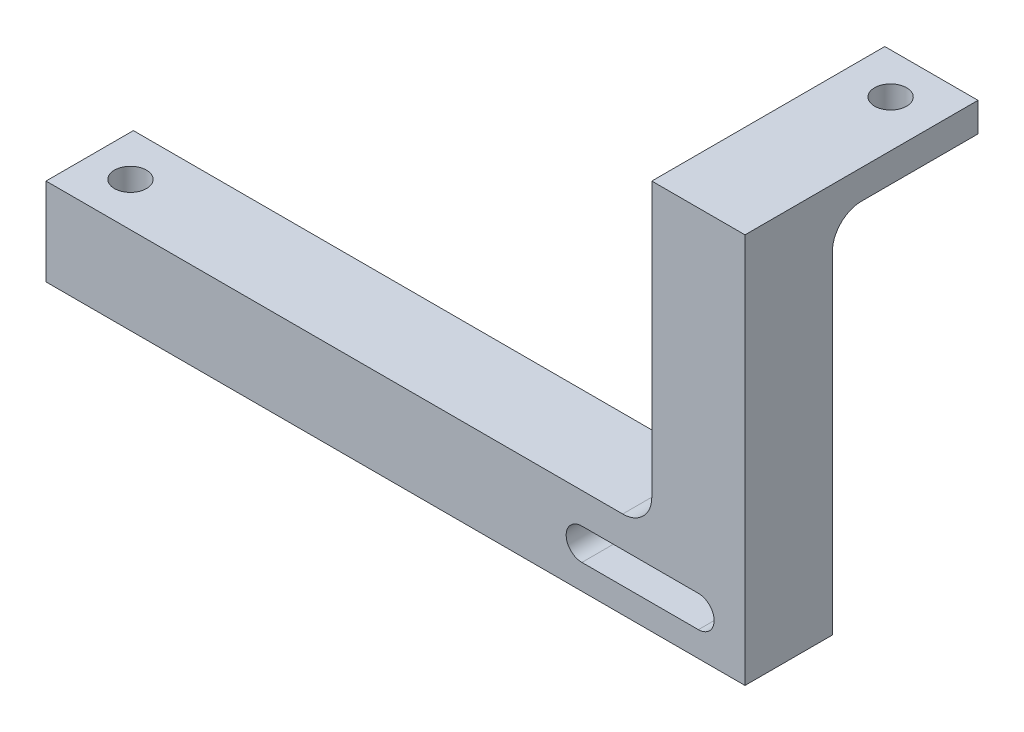
ISO-10303-21;
HEADER;
FILE_DESCRIPTION(('STEP AP214'),'2;1');
FILE_NAME('part.step','',(''),(''),'','','');
FILE_SCHEMA(('AUTOMOTIVE_DESIGN { 1 0 10303 214 1 1 1 1 }'));
ENDSEC;
DATA;
#1=APPLICATION_CONTEXT('core data for automotive mechanical design processes');
#2=APPLICATION_PROTOCOL_DEFINITION('international standard','automotive_design',2000,#1);
#3=PRODUCT_CONTEXT('',#1,'mechanical');
#4=PRODUCT('Part','Part','',(#3));
#5=PRODUCT_RELATED_PRODUCT_CATEGORY('part','',(#4));
#6=PRODUCT_DEFINITION_FORMATION('','',#4);
#7=PRODUCT_DEFINITION_CONTEXT('part definition',#1,'design');
#8=PRODUCT_DEFINITION('design','',#6,#7);
#9=PRODUCT_DEFINITION_SHAPE('','',#8);
#10=(LENGTH_UNIT() NAMED_UNIT(*) SI_UNIT(.MILLI.,.METRE.));
#11=(NAMED_UNIT(*) PLANE_ANGLE_UNIT() SI_UNIT($,.RADIAN.));
#12=(NAMED_UNIT(*) SI_UNIT($,.STERADIAN.) SOLID_ANGLE_UNIT());
#13=UNCERTAINTY_MEASURE_WITH_UNIT(LENGTH_MEASURE(1.E-05),#10,'distance_accuracy_value','');
#14=(GEOMETRIC_REPRESENTATION_CONTEXT(3) GLOBAL_UNCERTAINTY_ASSIGNED_CONTEXT((#13)) GLOBAL_UNIT_ASSIGNED_CONTEXT((#10,
#11,#12)) REPRESENTATION_CONTEXT('',''));
#15=CARTESIAN_POINT('',(0.,0.,0.));
#16=DIRECTION('',(0.,0.,1.));
#17=DIRECTION('',(1.,0.,0.));
#18=AXIS2_PLACEMENT_3D('',#15,#16,#17);
#19=CARTESIAN_POINT('',(0.,62.,15.));
#20=DIRECTION('',(-1.,0.,0.));
#21=DIRECTION('',(0.,-1.,0.));
#22=AXIS2_PLACEMENT_3D('',#19,#20,#21);
#23=PLANE('',#22);
#24=DIRECTION('',(0.,1.,0.));
#25=VECTOR('',#24,1.);
#26=CARTESIAN_POINT('',(0.,62.,0.));
#27=LINE('',#26,#25);
#28=CARTESIAN_POINT('',(0.,0.,0.));
#29=VERTEX_POINT('',#28);
#30=CARTESIAN_POINT('',(0.,57.,0.));
#31=VERTEX_POINT('',#30);
#32=EDGE_CURVE('E186',#29,#31,#27,.T.);
#33=ORIENTED_EDGE('',*,*,#32,.T.);
#34=CARTESIAN_POINT('',(0.,57.,-5.));
#35=DIRECTION('',(-1.,0.,0.));
#36=DIRECTION('',(0.,-1.,0.));
#37=AXIS2_PLACEMENT_3D('',#34,#35,#36);
#38=CIRCLE('',#37,5.);
#39=CARTESIAN_POINT('',(0.,62.,-5.));
#40=VERTEX_POINT('',#39);
#41=EDGE_CURVE('E242',#31,#40,#38,.T.);
#42=ORIENTED_EDGE('',*,*,#41,.T.);
#43=DIRECTION('',(0.,0.,1.));
#44=VECTOR('',#43,1.);
#45=CARTESIAN_POINT('',(0.,62.,-25.));
#46=LINE('',#45,#44);
#47=CARTESIAN_POINT('',(0.,62.,-25.));
#48=VERTEX_POINT('',#47);
#49=EDGE_CURVE('E190',#48,#40,#46,.T.);
#50=ORIENTED_EDGE('',*,*,#49,.F.);
#51=DIRECTION('',(0.,1.,0.));
#52=VECTOR('',#51,1.);
#53=CARTESIAN_POINT('',(0.,62.,-25.));
#54=LINE('',#53,#52);
#55=CARTESIAN_POINT('',(0.,67.,-25.));
#56=VERTEX_POINT('',#55);
#57=EDGE_CURVE('E174',#48,#56,#54,.T.);
#58=ORIENTED_EDGE('',*,*,#57,.T.);
#59=DIRECTION('',(0.,0.,1.));
#60=VECTOR('',#59,1.);
#61=CARTESIAN_POINT('',(0.,67.,-25.));
#62=LINE('',#61,#60);
#63=CARTESIAN_POINT('',(0.,67.,15.));
#64=VERTEX_POINT('',#63);
#65=EDGE_CURVE('E187',#56,#64,#62,.T.);
#66=ORIENTED_EDGE('',*,*,#65,.T.);
#67=DIRECTION('',(0.,1.,0.));
#68=VECTOR('',#67,1.);
#69=CARTESIAN_POINT('',(0.,62.,15.));
#70=LINE('',#69,#68);
#71=CARTESIAN_POINT('',(0.,0.,15.));
#72=VERTEX_POINT('',#71);
#73=EDGE_CURVE('E195',#72,#64,#70,.T.);
#74=ORIENTED_EDGE('',*,*,#73,.F.);
#75=DIRECTION('',(0.,0.,-1.));
#76=VECTOR('',#75,1.);
#77=CARTESIAN_POINT('',(0.,0.,15.));
#78=LINE('',#77,#76);
#79=EDGE_CURVE('E206',#72,#29,#78,.T.);
#80=ORIENTED_EDGE('',*,*,#79,.T.);
#81=EDGE_LOOP('',(#33,#42,#50,#58,#66,#74,#80));
#82=FACE_BOUND('',#81,.T.);
#83=ADVANCED_FACE('F33',(#82),#23,.F.);
#84=CARTESIAN_POINT('',(-16.,62.,15.));
#85=DIRECTION('',(1.,0.,0.));
#86=DIRECTION('',(0.,1.,0.));
#87=AXIS2_PLACEMENT_3D('',#84,#85,#86);
#88=PLANE('',#87);
#89=DIRECTION('',(0.,-1.,0.));
#90=VECTOR('',#89,1.);
#91=CARTESIAN_POINT('',(-16.,62.,0.));
#92=LINE('',#91,#90);
#93=CARTESIAN_POINT('',(-16.,57.,0.));
#94=VERTEX_POINT('',#93);
#95=CARTESIAN_POINT('',(-16.,20.,0.));
#96=VERTEX_POINT('',#95);
#97=EDGE_CURVE('E209',#94,#96,#92,.T.);
#98=ORIENTED_EDGE('',*,*,#97,.T.);
#99=DIRECTION('',(0.,0.,-1.));
#100=VECTOR('',#99,1.);
#101=CARTESIAN_POINT('',(-16.,20.,15.));
#102=LINE('',#101,#100);
#103=CARTESIAN_POINT('',(-16.,20.,15.));
#104=VERTEX_POINT('',#103);
#105=EDGE_CURVE('E48',#96,#104,#102,.F.);
#106=ORIENTED_EDGE('',*,*,#105,.T.);
#107=DIRECTION('',(0.,-1.,0.));
#108=VECTOR('',#107,1.);
#109=CARTESIAN_POINT('',(-16.,62.,15.));
#110=LINE('',#109,#108);
#111=CARTESIAN_POINT('',(-16.,67.,15.));
#112=VERTEX_POINT('',#111);
#113=EDGE_CURVE('E197',#112,#104,#110,.T.);
#114=ORIENTED_EDGE('',*,*,#113,.F.);
#115=DIRECTION('',(0.,0.,1.));
#116=VECTOR('',#115,1.);
#117=CARTESIAN_POINT('',(-16.,67.,-25.));
#118=LINE('',#117,#116);
#119=CARTESIAN_POINT('',(-16.,67.,-25.));
#120=VERTEX_POINT('',#119);
#121=EDGE_CURVE('E183',#120,#112,#118,.T.);
#122=ORIENTED_EDGE('',*,*,#121,.F.);
#123=DIRECTION('',(0.,-1.,0.));
#124=VECTOR('',#123,1.);
#125=CARTESIAN_POINT('',(-16.,62.,-25.));
#126=LINE('',#125,#124);
#127=CARTESIAN_POINT('',(-16.,62.,-25.));
#128=VERTEX_POINT('',#127);
#129=EDGE_CURVE('E168',#120,#128,#126,.T.);
#130=ORIENTED_EDGE('',*,*,#129,.T.);
#131=DIRECTION('',(0.,0.,1.));
#132=VECTOR('',#131,1.);
#133=CARTESIAN_POINT('',(-16.,62.,-25.));
#134=LINE('',#133,#132);
#135=CARTESIAN_POINT('',(-16.,62.,-5.));
#136=VERTEX_POINT('',#135);
#137=EDGE_CURVE('E180',#128,#136,#134,.T.);
#138=ORIENTED_EDGE('',*,*,#137,.T.);
#139=CARTESIAN_POINT('',(-16.,57.,-5.));
#140=DIRECTION('',(1.,0.,0.));
#141=DIRECTION('',(0.,1.,0.));
#142=AXIS2_PLACEMENT_3D('',#139,#140,#141);
#143=CIRCLE('',#142,5.);
#144=EDGE_CURVE('E240',#136,#94,#143,.T.);
#145=ORIENTED_EDGE('',*,*,#144,.T.);
#146=EDGE_LOOP('',(#98,#106,#114,#122,#130,#138,#145));
#147=FACE_BOUND('',#146,.T.);
#148=ADVANCED_FACE('F251',(#147),#88,.F.);
#149=CARTESIAN_POINT('',(-120.,15.,15.));
#150=DIRECTION('',(0.,-1.,0.));
#151=DIRECTION('',(0.,0.,-1.));
#152=AXIS2_PLACEMENT_3D('',#149,#150,#151);
#153=PLANE('',#152);
#154=CARTESIAN_POINT('',(-113.,15.,7.5));
#155=DIRECTION('',(0.,-1.,0.));
#156=DIRECTION('',(0.,0.,-1.));
#157=AXIS2_PLACEMENT_3D('',#154,#155,#156);
#158=CIRCLE('',#157,2.74999999999999);
#159=CARTESIAN_POINT('',(-113.,15.,4.75000000000001));
#160=VERTEX_POINT('',#159);
#161=EDGE_CURVE('E341',#160,#160,#158,.T.);
#162=ORIENTED_EDGE('',*,*,#161,.T.);
#163=EDGE_LOOP('',(#162));
#164=FACE_BOUND('',#163,.T.);
#165=DIRECTION('',(-1.,0.,0.));
#166=VECTOR('',#165,1.);
#167=CARTESIAN_POINT('',(-120.,15.,15.));
#168=LINE('',#167,#166);
#169=CARTESIAN_POINT('',(-21.,15.,15.));
#170=VERTEX_POINT('',#169);
#171=CARTESIAN_POINT('',(-120.,15.,15.));
#172=VERTEX_POINT('',#171);
#173=EDGE_CURVE('E200',#170,#172,#168,.T.);
#174=ORIENTED_EDGE('',*,*,#173,.F.);
#175=DIRECTION('',(0.,0.,-1.));
#176=VECTOR('',#175,1.);
#177=CARTESIAN_POINT('',(-21.,15.,0.));
#178=LINE('',#177,#176);
#179=CARTESIAN_POINT('',(-21.,15.,0.));
#180=VERTEX_POINT('',#179);
#181=EDGE_CURVE('E236',#170,#180,#178,.T.);
#182=ORIENTED_EDGE('',*,*,#181,.T.);
#183=DIRECTION('',(-1.,0.,0.));
#184=VECTOR('',#183,1.);
#185=CARTESIAN_POINT('',(-120.,15.,0.));
#186=LINE('',#185,#184);
#187=CARTESIAN_POINT('',(-120.,15.,0.));
#188=VERTEX_POINT('',#187);
#189=EDGE_CURVE('E211',#180,#188,#186,.T.);
#190=ORIENTED_EDGE('',*,*,#189,.T.);
#191=DIRECTION('',(0.,0.,-1.));
#192=VECTOR('',#191,1.);
#193=CARTESIAN_POINT('',(-120.,15.,15.));
#194=LINE('',#193,#192);
#195=EDGE_CURVE('E221',#172,#188,#194,.T.);
#196=ORIENTED_EDGE('',*,*,#195,.F.);
#197=EDGE_LOOP('',(#174,#182,#190,#196));
#198=FACE_BOUND('',#197,.T.);
#199=ADVANCED_FACE('F253',(#164,#198),#153,.F.);
#200=CARTESIAN_POINT('',(-120.,0.,15.));
#201=DIRECTION('',(1.,0.,0.));
#202=DIRECTION('',(0.,0.,-1.));
#203=AXIS2_PLACEMENT_3D('',#200,#201,#202);
#204=PLANE('',#203);
#205=DIRECTION('',(0.,-1.,0.));
#206=VECTOR('',#205,1.);
#207=CARTESIAN_POINT('',(-120.,0.,0.));
#208=LINE('',#207,#206);
#209=CARTESIAN_POINT('',(-120.,0.,0.));
#210=VERTEX_POINT('',#209);
#211=EDGE_CURVE('E213',#188,#210,#208,.T.);
#212=ORIENTED_EDGE('',*,*,#211,.T.);
#213=DIRECTION('',(0.,0.,-1.));
#214=VECTOR('',#213,1.);
#215=CARTESIAN_POINT('',(-120.,0.,15.));
#216=LINE('',#215,#214);
#217=CARTESIAN_POINT('',(-120.,0.,15.));
#218=VERTEX_POINT('',#217);
#219=EDGE_CURVE('E218',#218,#210,#216,.T.);
#220=ORIENTED_EDGE('',*,*,#219,.F.);
#221=DIRECTION('',(0.,-1.,0.));
#222=VECTOR('',#221,1.);
#223=CARTESIAN_POINT('',(-120.,0.,15.));
#224=LINE('',#223,#222);
#225=EDGE_CURVE('E202',#172,#218,#224,.T.);
#226=ORIENTED_EDGE('',*,*,#225,.F.);
#227=ORIENTED_EDGE('',*,*,#195,.T.);
#228=EDGE_LOOP('',(#212,#220,#226,#227));
#229=FACE_BOUND('',#228,.T.);
#230=ADVANCED_FACE('F260',(#229),#204,.F.);
#231=CARTESIAN_POINT('',(0.,0.,15.));
#232=DIRECTION('',(0.,1.,0.));
#233=DIRECTION('',(-1.,0.,0.));
#234=AXIS2_PLACEMENT_3D('',#231,#232,#233);
#235=PLANE('',#234);
#236=CARTESIAN_POINT('',(-113.,0.,7.5));
#237=DIRECTION('',(0.,1.,0.));
#238=DIRECTION('',(-1.,0.,0.));
#239=AXIS2_PLACEMENT_3D('',#236,#237,#238);
#240=CIRCLE('',#239,2.74999999999999);
#241=CARTESIAN_POINT('',(-115.75,0.,7.5));
#242=VERTEX_POINT('',#241);
#243=EDGE_CURVE('E338',#242,#242,#240,.T.);
#244=ORIENTED_EDGE('',*,*,#243,.T.);
#245=EDGE_LOOP('',(#244));
#246=FACE_BOUND('',#245,.T.);
#247=DIRECTION('',(1.,0.,0.));
#248=VECTOR('',#247,1.);
#249=CARTESIAN_POINT('',(0.,0.,0.));
#250=LINE('',#249,#248);
#251=EDGE_CURVE('E198',#210,#29,#250,.T.);
#252=ORIENTED_EDGE('',*,*,#251,.T.);
#253=ORIENTED_EDGE('',*,*,#79,.F.);
#254=DIRECTION('',(1.,0.,0.));
#255=VECTOR('',#254,1.);
#256=CARTESIAN_POINT('',(0.,0.,15.));
#257=LINE('',#256,#255);
#258=EDGE_CURVE('E204',#218,#72,#257,.T.);
#259=ORIENTED_EDGE('',*,*,#258,.F.);
#260=ORIENTED_EDGE('',*,*,#219,.T.);
#261=EDGE_LOOP('',(#252,#253,#259,#260));
#262=FACE_BOUND('',#261,.T.);
#263=ADVANCED_FACE('F263',(#246,#262),#235,.F.);
#264=CARTESIAN_POINT('',(0.,0.,15.));
#265=DIRECTION('',(0.,0.,-1.));
#266=DIRECTION('',(-1.,0.,0.));
#267=AXIS2_PLACEMENT_3D('',#264,#265,#266);
#268=PLANE('',#267);
#269=DIRECTION('',(1.,0.,0.));
#270=VECTOR('',#269,1.);
#271=CARTESIAN_POINT('',(-28.,4.29999999999998,15.));
#272=LINE('',#271,#270);
#273=CARTESIAN_POINT('',(-28.,4.29999999999998,15.));
#274=VERTEX_POINT('',#273);
#275=CARTESIAN_POINT('',(-7.99999999999999,4.29999999999998,15.));
#276=VERTEX_POINT('',#275);
#277=EDGE_CURVE('E149',#274,#276,#272,.T.);
#278=ORIENTED_EDGE('',*,*,#277,.F.);
#279=CARTESIAN_POINT('',(-28.,6.99999999999999,15.));
#280=DIRECTION('',(0.,0.,1.));
#281=DIRECTION('',(1.,0.,0.));
#282=AXIS2_PLACEMENT_3D('',#279,#280,#281);
#283=CIRCLE('',#282,2.7);
#284=CARTESIAN_POINT('',(-28.,9.69999999999999,15.));
#285=VERTEX_POINT('',#284);
#286=EDGE_CURVE('E154',#285,#274,#283,.T.);
#287=ORIENTED_EDGE('',*,*,#286,.F.);
#288=DIRECTION('',(-1.,0.,0.));
#289=VECTOR('',#288,1.);
#290=CARTESIAN_POINT('',(-28.,9.69999999999999,15.));
#291=LINE('',#290,#289);
#292=CARTESIAN_POINT('',(-7.99999999999999,9.69999999999999,15.));
#293=VERTEX_POINT('',#292);
#294=EDGE_CURVE('E158',#293,#285,#291,.T.);
#295=ORIENTED_EDGE('',*,*,#294,.F.);
#296=CARTESIAN_POINT('',(-7.99999999999999,6.99999999999999,15.));
#297=DIRECTION('',(0.,0.,1.));
#298=DIRECTION('',(1.,0.,0.));
#299=AXIS2_PLACEMENT_3D('',#296,#297,#298);
#300=CIRCLE('',#299,2.7);
#301=EDGE_CURVE('E138',#276,#293,#300,.T.);
#302=ORIENTED_EDGE('',*,*,#301,.F.);
#303=EDGE_LOOP('',(#278,#287,#295,#302));
#304=FACE_BOUND('',#303,.T.);
#305=ORIENTED_EDGE('',*,*,#73,.T.);
#306=DIRECTION('',(-1.,0.,0.));
#307=VECTOR('',#306,1.);
#308=CARTESIAN_POINT('',(-16.,67.,15.));
#309=LINE('',#308,#307);
#310=EDGE_CURVE('E165',#64,#112,#309,.T.);
#311=ORIENTED_EDGE('',*,*,#310,.T.);
#312=ORIENTED_EDGE('',*,*,#113,.T.);
#313=CARTESIAN_POINT('',(-21.,20.,15.));
#314=DIRECTION('',(0.,0.,-1.));
#315=DIRECTION('',(-1.,0.,0.));
#316=AXIS2_PLACEMENT_3D('',#313,#314,#315);
#317=CIRCLE('',#316,5.);
#318=EDGE_CURVE('E11',#104,#170,#317,.T.);
#319=ORIENTED_EDGE('',*,*,#318,.T.);
#320=ORIENTED_EDGE('',*,*,#173,.T.);
#321=ORIENTED_EDGE('',*,*,#225,.T.);
#322=ORIENTED_EDGE('',*,*,#258,.T.);
#323=EDGE_LOOP('',(#305,#311,#312,#319,#320,#321,#322));
#324=FACE_BOUND('',#323,.T.);
#325=ADVANCED_FACE('F156',(#304,#324),#268,.F.);
#326=CARTESIAN_POINT('',(0.,0.,0.));
#327=DIRECTION('',(0.,0.,-1.));
#328=DIRECTION('',(-1.,0.,0.));
#329=AXIS2_PLACEMENT_3D('',#326,#327,#328);
#330=PLANE('',#329);
#331=CARTESIAN_POINT('',(-28.,6.99999999999999,0.));
#332=DIRECTION('',(0.,0.,-1.));
#333=DIRECTION('',(-1.,0.,0.));
#334=AXIS2_PLACEMENT_3D('',#331,#332,#333);
#335=CIRCLE('',#334,2.7);
#336=CARTESIAN_POINT('',(-28.,4.29999999999998,0.));
#337=VERTEX_POINT('',#336);
#338=CARTESIAN_POINT('',(-28.,9.69999999999999,0.));
#339=VERTEX_POINT('',#338);
#340=EDGE_CURVE('E229',#337,#339,#335,.T.);
#341=ORIENTED_EDGE('',*,*,#340,.F.);
#342=DIRECTION('',(-1.,0.,0.));
#343=VECTOR('',#342,1.);
#344=CARTESIAN_POINT('',(0.,4.29999999999998,0.));
#345=LINE('',#344,#343);
#346=CARTESIAN_POINT('',(-7.99999999999999,4.29999999999998,0.));
#347=VERTEX_POINT('',#346);
#348=EDGE_CURVE('E224',#347,#337,#345,.T.);
#349=ORIENTED_EDGE('',*,*,#348,.F.);
#350=CARTESIAN_POINT('',(-7.99999999999999,6.99999999999999,0.));
#351=DIRECTION('',(0.,0.,-1.));
#352=DIRECTION('',(-1.,0.,0.));
#353=AXIS2_PLACEMENT_3D('',#350,#351,#352);
#354=CIRCLE('',#353,2.7);
#355=CARTESIAN_POINT('',(-7.99999999999999,9.69999999999999,0.));
#356=VERTEX_POINT('',#355);
#357=EDGE_CURVE('E141',#356,#347,#354,.T.);
#358=ORIENTED_EDGE('',*,*,#357,.F.);
#359=DIRECTION('',(1.,0.,0.));
#360=VECTOR('',#359,1.);
#361=CARTESIAN_POINT('',(0.,9.69999999999999,0.));
#362=LINE('',#361,#360);
#363=EDGE_CURVE('E227',#339,#356,#362,.T.);
#364=ORIENTED_EDGE('',*,*,#363,.F.);
#365=EDGE_LOOP('',(#341,#349,#358,#364));
#366=FACE_BOUND('',#365,.T.);
#367=ORIENTED_EDGE('',*,*,#97,.F.);
#368=DIRECTION('',(-1.,0.,0.));
#369=VECTOR('',#368,1.);
#370=CARTESIAN_POINT('',(0.,57.,0.));
#371=LINE('',#370,#369);
#372=EDGE_CURVE('E234',#94,#31,#371,.F.);
#373=ORIENTED_EDGE('',*,*,#372,.T.);
#374=ORIENTED_EDGE('',*,*,#32,.F.);
#375=ORIENTED_EDGE('',*,*,#251,.F.);
#376=ORIENTED_EDGE('',*,*,#211,.F.);
#377=ORIENTED_EDGE('',*,*,#189,.F.);
#378=CARTESIAN_POINT('',(-21.,20.,0.));
#379=DIRECTION('',(0.,0.,-1.));
#380=DIRECTION('',(-1.,0.,0.));
#381=AXIS2_PLACEMENT_3D('',#378,#379,#380);
#382=CIRCLE('',#381,5.);
#383=EDGE_CURVE('E41',#180,#96,#382,.F.);
#384=ORIENTED_EDGE('',*,*,#383,.T.);
#385=EDGE_LOOP('',(#367,#373,#374,#375,#376,#377,#384));
#386=FACE_BOUND('',#385,.T.);
#387=ADVANCED_FACE('F246',(#366,#386),#330,.T.);
#388=CARTESIAN_POINT('',(-16.,67.,-25.));
#389=DIRECTION('',(0.,1.,0.));
#390=DIRECTION('',(0.,0.,1.));
#391=AXIS2_PLACEMENT_3D('',#388,#389,#390);
#392=PLANE('',#391);
#393=CARTESIAN_POINT('',(-7.99999999999998,67.,-18.));
#394=DIRECTION('',(0.,1.,0.));
#395=DIRECTION('',(0.,0.,1.));
#396=AXIS2_PLACEMENT_3D('',#393,#394,#395);
#397=CIRCLE('',#396,2.74999999999999);
#398=CARTESIAN_POINT('',(-7.99999999999998,67.,-15.25));
#399=VERTEX_POINT('',#398);
#400=EDGE_CURVE('E348',#399,#399,#397,.T.);
#401=ORIENTED_EDGE('',*,*,#400,.F.);
#402=EDGE_LOOP('',(#401));
#403=FACE_BOUND('',#402,.T.);
#404=ORIENTED_EDGE('',*,*,#310,.F.);
#405=ORIENTED_EDGE('',*,*,#65,.F.);
#406=DIRECTION('',(-1.,0.,0.));
#407=VECTOR('',#406,1.);
#408=CARTESIAN_POINT('',(-16.,67.,-25.));
#409=LINE('',#408,#407);
#410=EDGE_CURVE('E177',#56,#120,#409,.T.);
#411=ORIENTED_EDGE('',*,*,#410,.T.);
#412=ORIENTED_EDGE('',*,*,#121,.T.);
#413=EDGE_LOOP('',(#404,#405,#411,#412));
#414=FACE_BOUND('',#413,.T.);
#415=ADVANCED_FACE('F269',(#403,#414),#392,.T.);
#416=CARTESIAN_POINT('',(-16.,62.,-25.));
#417=DIRECTION('',(0.,-1.,0.));
#418=DIRECTION('',(0.,0.,-1.));
#419=AXIS2_PLACEMENT_3D('',#416,#417,#418);
#420=PLANE('',#419);
#421=CARTESIAN_POINT('',(-7.99999999999998,62.,-18.));
#422=DIRECTION('',(0.,-1.,0.));
#423=DIRECTION('',(0.,0.,-1.));
#424=AXIS2_PLACEMENT_3D('',#421,#422,#423);
#425=CIRCLE('',#424,2.74999999999999);
#426=CARTESIAN_POINT('',(-7.99999999999998,62.,-20.75));
#427=VERTEX_POINT('',#426);
#428=EDGE_CURVE('E343',#427,#427,#425,.T.);
#429=ORIENTED_EDGE('',*,*,#428,.F.);
#430=EDGE_LOOP('',(#429));
#431=FACE_BOUND('',#430,.T.);
#432=ORIENTED_EDGE('',*,*,#49,.T.);
#433=DIRECTION('',(-1.,0.,0.));
#434=VECTOR('',#433,1.);
#435=CARTESIAN_POINT('',(-16.,62.,-5.));
#436=LINE('',#435,#434);
#437=EDGE_CURVE('E231',#40,#136,#436,.T.);
#438=ORIENTED_EDGE('',*,*,#437,.T.);
#439=ORIENTED_EDGE('',*,*,#137,.F.);
#440=DIRECTION('',(1.,0.,0.));
#441=VECTOR('',#440,1.);
#442=CARTESIAN_POINT('',(-16.,62.,-25.));
#443=LINE('',#442,#441);
#444=EDGE_CURVE('E171',#128,#48,#443,.T.);
#445=ORIENTED_EDGE('',*,*,#444,.T.);
#446=EDGE_LOOP('',(#432,#438,#439,#445));
#447=FACE_BOUND('',#446,.T.);
#448=ADVANCED_FACE('F277',(#431,#447),#420,.T.);
#449=CARTESIAN_POINT('',(0.,0.,-25.));
#450=DIRECTION('',(0.,0.,-1.));
#451=DIRECTION('',(-1.,0.,0.));
#452=AXIS2_PLACEMENT_3D('',#449,#450,#451);
#453=PLANE('',#452);
#454=ORIENTED_EDGE('',*,*,#129,.F.);
#455=ORIENTED_EDGE('',*,*,#410,.F.);
#456=ORIENTED_EDGE('',*,*,#57,.F.);
#457=ORIENTED_EDGE('',*,*,#444,.F.);
#458=EDGE_LOOP('',(#454,#455,#456,#457));
#459=FACE_BOUND('',#458,.T.);
#460=ADVANCED_FACE('F274',(#459),#453,.T.);
#461=CARTESIAN_POINT('',(-28.,6.99999999999999,-30.));
#462=DIRECTION('',(0.,0.,1.));
#463=DIRECTION('',(1.,0.,0.));
#464=AXIS2_PLACEMENT_3D('',#461,#462,#463);
#465=CYLINDRICAL_SURFACE('',#464,2.7);
#466=ORIENTED_EDGE('',*,*,#340,.T.);
#467=DIRECTION('',(0.,0.,1.));
#468=VECTOR('',#467,1.);
#469=CARTESIAN_POINT('',(-28.,9.69999999999999,-30.));
#470=LINE('',#469,#468);
#471=EDGE_CURVE('E163',#339,#285,#470,.T.);
#472=ORIENTED_EDGE('',*,*,#471,.T.);
#473=ORIENTED_EDGE('',*,*,#286,.T.);
#474=DIRECTION('',(0.,0.,1.));
#475=VECTOR('',#474,1.);
#476=CARTESIAN_POINT('',(-28.,4.29999999999998,-30.));
#477=LINE('',#476,#475);
#478=EDGE_CURVE('E145',#337,#274,#477,.T.);
#479=ORIENTED_EDGE('',*,*,#478,.F.);
#480=EDGE_LOOP('',(#466,#472,#473,#479));
#481=FACE_BOUND('',#480,.T.);
#482=ADVANCED_FACE('F319',(#481),#465,.F.);
#483=CARTESIAN_POINT('',(-28.,9.69999999999999,-30.));
#484=DIRECTION('',(0.,1.,0.));
#485=DIRECTION('',(0.,0.,1.));
#486=AXIS2_PLACEMENT_3D('',#483,#484,#485);
#487=PLANE('',#486);
#488=ORIENTED_EDGE('',*,*,#363,.T.);
#489=DIRECTION('',(0.,0.,1.));
#490=VECTOR('',#489,1.);
#491=CARTESIAN_POINT('',(-7.99999999999999,9.69999999999999,-30.));
#492=LINE('',#491,#490);
#493=EDGE_CURVE('E144',#356,#293,#492,.T.);
#494=ORIENTED_EDGE('',*,*,#493,.T.);
#495=ORIENTED_EDGE('',*,*,#294,.T.);
#496=ORIENTED_EDGE('',*,*,#471,.F.);
#497=EDGE_LOOP('',(#488,#494,#495,#496));
#498=FACE_BOUND('',#497,.T.);
#499=ADVANCED_FACE('F322',(#498),#487,.F.);
#500=CARTESIAN_POINT('',(-7.99999999999999,6.99999999999999,-30.));
#501=DIRECTION('',(0.,0.,1.));
#502=DIRECTION('',(1.,0.,0.));
#503=AXIS2_PLACEMENT_3D('',#500,#501,#502);
#504=CYLINDRICAL_SURFACE('',#503,2.7);
#505=ORIENTED_EDGE('',*,*,#357,.T.);
#506=DIRECTION('',(0.,0.,1.));
#507=VECTOR('',#506,1.);
#508=CARTESIAN_POINT('',(-7.99999999999999,4.29999999999998,-30.));
#509=LINE('',#508,#507);
#510=EDGE_CURVE('E133',#347,#276,#509,.T.);
#511=ORIENTED_EDGE('',*,*,#510,.T.);
#512=ORIENTED_EDGE('',*,*,#301,.T.);
#513=ORIENTED_EDGE('',*,*,#493,.F.);
#514=EDGE_LOOP('',(#505,#511,#512,#513));
#515=FACE_BOUND('',#514,.T.);
#516=ADVANCED_FACE('F135',(#515),#504,.F.);
#517=CARTESIAN_POINT('',(-28.,4.29999999999998,-30.));
#518=DIRECTION('',(0.,-1.,0.));
#519=DIRECTION('',(0.,0.,-1.));
#520=AXIS2_PLACEMENT_3D('',#517,#518,#519);
#521=PLANE('',#520);
#522=ORIENTED_EDGE('',*,*,#348,.T.);
#523=ORIENTED_EDGE('',*,*,#478,.T.);
#524=ORIENTED_EDGE('',*,*,#277,.T.);
#525=ORIENTED_EDGE('',*,*,#510,.F.);
#526=EDGE_LOOP('',(#522,#523,#524,#525));
#527=FACE_BOUND('',#526,.T.);
#528=ADVANCED_FACE('F150',(#527),#521,.F.);
#529=CARTESIAN_POINT('',(-113.,67.,7.5));
#530=DIRECTION('',(0.,1.,0.));
#531=DIRECTION('',(0.,0.,1.));
#532=AXIS2_PLACEMENT_3D('',#529,#530,#531);
#533=CYLINDRICAL_SURFACE('',#532,2.74999999999999);
#534=ORIENTED_EDGE('',*,*,#243,.F.);
#535=EDGE_LOOP('',(#534));
#536=FACE_BOUND('',#535,.T.);
#537=ORIENTED_EDGE('',*,*,#161,.F.);
#538=EDGE_LOOP('',(#537));
#539=FACE_BOUND('',#538,.T.);
#540=ADVANCED_FACE('F288',(#536,#539),#533,.F.);
#541=CARTESIAN_POINT('',(-7.99999999999998,67.,-18.));
#542=DIRECTION('',(0.,1.,0.));
#543=DIRECTION('',(0.,0.,1.));
#544=AXIS2_PLACEMENT_3D('',#541,#542,#543);
#545=CYLINDRICAL_SURFACE('',#544,2.74999999999999);
#546=ORIENTED_EDGE('',*,*,#400,.T.);
#547=EDGE_LOOP('',(#546));
#548=FACE_BOUND('',#547,.T.);
#549=ORIENTED_EDGE('',*,*,#428,.T.);
#550=EDGE_LOOP('',(#549));
#551=FACE_BOUND('',#550,.T.);
#552=ADVANCED_FACE('F283',(#548,#551),#545,.F.);
#553=CARTESIAN_POINT('',(-16.,57.,-5.));
#554=DIRECTION('',(1.,0.,0.));
#555=DIRECTION('',(0.,0.,-1.));
#556=AXIS2_PLACEMENT_3D('',#553,#554,#555);
#557=CYLINDRICAL_SURFACE('',#556,5.);
#558=ORIENTED_EDGE('',*,*,#41,.F.);
#559=ORIENTED_EDGE('',*,*,#372,.F.);
#560=ORIENTED_EDGE('',*,*,#144,.F.);
#561=ORIENTED_EDGE('',*,*,#437,.F.);
#562=EDGE_LOOP('',(#558,#559,#560,#561));
#563=FACE_BOUND('',#562,.T.);
#564=ADVANCED_FACE('F281',(#563),#557,.F.);
#565=CARTESIAN_POINT('',(-21.,20.,15.));
#566=DIRECTION('',(0.,0.,1.));
#567=DIRECTION('',(1.,0.,0.));
#568=AXIS2_PLACEMENT_3D('',#565,#566,#567);
#569=CYLINDRICAL_SURFACE('',#568,5.);
#570=ORIENTED_EDGE('',*,*,#318,.F.);
#571=ORIENTED_EDGE('',*,*,#105,.F.);
#572=ORIENTED_EDGE('',*,*,#383,.F.);
#573=ORIENTED_EDGE('',*,*,#181,.F.);
#574=EDGE_LOOP('',(#570,#571,#572,#573));
#575=FACE_BOUND('',#574,.T.);
#576=ADVANCED_FACE('F35',(#575),#569,.F.);
#577=CLOSED_SHELL('',(#83,#148,#199,#230,#263,#325,#387,#415,#448,#460,#482,#499,#516,#528,#540,
#552,#564,#576));
#578=MANIFOLD_SOLID_BREP('B2',#577);
#579=ADVANCED_BREP_SHAPE_REPRESENTATION('',(#18,#578),#14);
#580=SHAPE_DEFINITION_REPRESENTATION(#9,#579);
ENDSEC;
END-ISO-10303-21;
